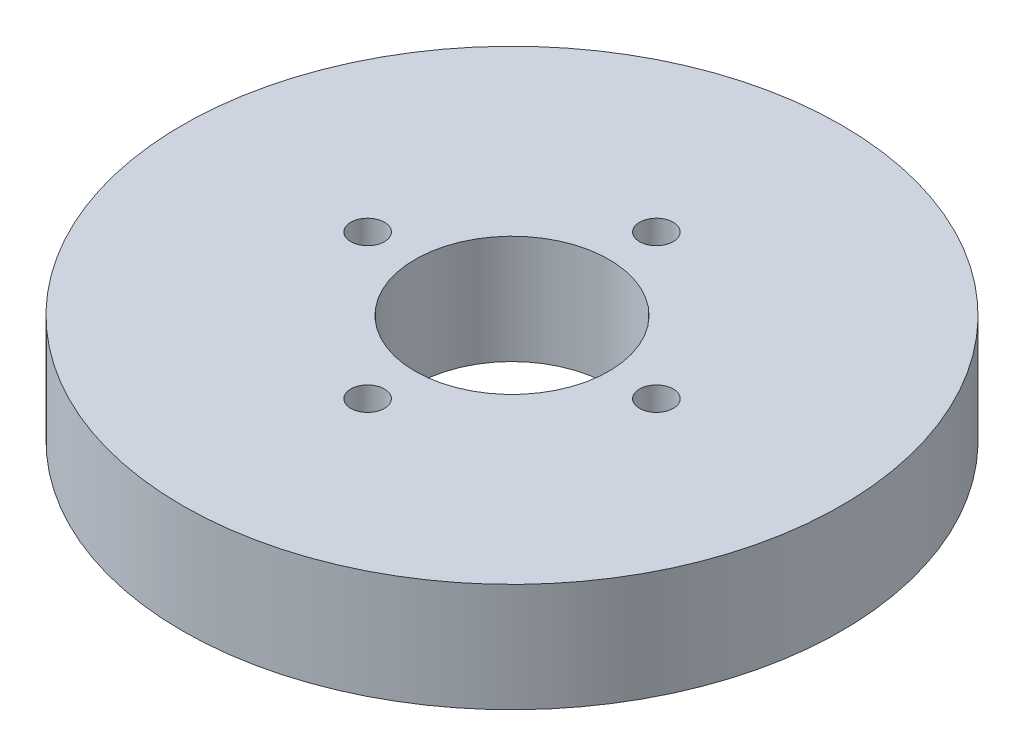
ISO-10303-21;
HEADER;
FILE_DESCRIPTION(('STEP AP214'),'2;1');
FILE_NAME('part.step','',(''),(''),'','','');
FILE_SCHEMA(('AUTOMOTIVE_DESIGN { 1 0 10303 214 1 1 1 1 }'));
ENDSEC;
DATA;
#1=APPLICATION_CONTEXT('core data for automotive mechanical design processes');
#2=APPLICATION_PROTOCOL_DEFINITION('international standard','automotive_design',2000,#1);
#3=PRODUCT_CONTEXT('',#1,'mechanical');
#4=PRODUCT('Part','Part','',(#3));
#5=PRODUCT_RELATED_PRODUCT_CATEGORY('part','',(#4));
#6=PRODUCT_DEFINITION_FORMATION('','',#4);
#7=PRODUCT_DEFINITION_CONTEXT('part definition',#1,'design');
#8=PRODUCT_DEFINITION('design','',#6,#7);
#9=PRODUCT_DEFINITION_SHAPE('','',#8);
#10=(LENGTH_UNIT() NAMED_UNIT(*) SI_UNIT(.MILLI.,.METRE.));
#11=(NAMED_UNIT(*) PLANE_ANGLE_UNIT() SI_UNIT($,.RADIAN.));
#12=(NAMED_UNIT(*) SI_UNIT($,.STERADIAN.) SOLID_ANGLE_UNIT());
#13=UNCERTAINTY_MEASURE_WITH_UNIT(LENGTH_MEASURE(1.E-05),#10,'distance_accuracy_value','');
#14=(GEOMETRIC_REPRESENTATION_CONTEXT(3) GLOBAL_UNCERTAINTY_ASSIGNED_CONTEXT((#13)) GLOBAL_UNIT_ASSIGNED_CONTEXT((#10,
#11,#12)) REPRESENTATION_CONTEXT('',''));
#15=CARTESIAN_POINT('',(0.,0.,0.));
#16=DIRECTION('',(0.,0.,1.));
#17=DIRECTION('',(1.,0.,0.));
#18=AXIS2_PLACEMENT_3D('',#15,#16,#17);
#19=CARTESIAN_POINT('',(0.,14.,0.));
#20=DIRECTION('',(0.,-1.,0.));
#21=DIRECTION('',(0.,0.,-1.));
#22=AXIS2_PLACEMENT_3D('',#19,#20,#21);
#23=CYLINDRICAL_SURFACE('',#22,42.5);
#24=CARTESIAN_POINT('',(0.,14.,0.));
#25=DIRECTION('',(0.,1.,0.));
#26=DIRECTION('',(0.,0.,1.));
#27=AXIS2_PLACEMENT_3D('',#24,#25,#26);
#28=CIRCLE('',#27,42.5);
#29=CARTESIAN_POINT('',(0.,14.,42.5));
#30=VERTEX_POINT('',#29);
#31=EDGE_CURVE('E10',#30,#30,#28,.T.);
#32=ORIENTED_EDGE('',*,*,#31,.F.);
#33=EDGE_LOOP('',(#32));
#34=FACE_BOUND('',#33,.T.);
#35=CARTESIAN_POINT('',(0.,0.,0.));
#36=DIRECTION('',(0.,1.,0.));
#37=DIRECTION('',(0.,0.,1.));
#38=AXIS2_PLACEMENT_3D('',#35,#36,#37);
#39=CIRCLE('',#38,42.5);
#40=CARTESIAN_POINT('',(0.,0.,42.5));
#41=VERTEX_POINT('',#40);
#42=EDGE_CURVE('E37',#41,#41,#39,.T.);
#43=ORIENTED_EDGE('',*,*,#42,.T.);
#44=EDGE_LOOP('',(#43));
#45=FACE_BOUND('',#44,.T.);
#46=ADVANCED_FACE('F40',(#34,#45),#23,.T.);
#47=CARTESIAN_POINT('',(0.,14.,0.));
#48=DIRECTION('',(0.,1.,0.));
#49=DIRECTION('',(0.,0.,1.));
#50=AXIS2_PLACEMENT_3D('',#47,#48,#49);
#51=PLANE('',#50);
#52=CARTESIAN_POINT('',(0.,14.,18.6195365157086));
#53=DIRECTION('',(0.,1.,0.));
#54=DIRECTION('',(1.,0.,0.));
#55=AXIS2_PLACEMENT_3D('',#52,#53,#54);
#56=CIRCLE('',#55,2.17306928861069);
#57=CARTESIAN_POINT('',(2.17306928861076,14.,18.6195365157086));
#58=VERTEX_POINT('',#57);
#59=EDGE_CURVE('E71',#58,#58,#56,.T.);
#60=ORIENTED_EDGE('',*,*,#59,.F.);
#61=EDGE_LOOP('',(#60));
#62=FACE_BOUND('',#61,.T.);
#63=CARTESIAN_POINT('',(18.6195365157086,14.,0.));
#64=DIRECTION('',(0.,1.,0.));
#65=DIRECTION('',(0.,0.,-1.));
#66=AXIS2_PLACEMENT_3D('',#63,#64,#65);
#67=CIRCLE('',#66,2.17306928861069);
#68=CARTESIAN_POINT('',(18.6195365157086,14.,-2.17306928861069));
#69=VERTEX_POINT('',#68);
#70=EDGE_CURVE('E70',#69,#69,#67,.T.);
#71=ORIENTED_EDGE('',*,*,#70,.F.);
#72=EDGE_LOOP('',(#71));
#73=FACE_BOUND('',#72,.T.);
#74=CARTESIAN_POINT('',(-1.95029292847515E-13,14.,-18.6195365157086));
#75=DIRECTION('',(0.,1.,0.));
#76=DIRECTION('',(-1.,0.,0.));
#77=AXIS2_PLACEMENT_3D('',#74,#75,#76);
#78=CIRCLE('',#77,2.17306928861069);
#79=CARTESIAN_POINT('',(-2.17306928861089,14.,-18.6195365157086));
#80=VERTEX_POINT('',#79);
#81=EDGE_CURVE('E61',#80,#80,#78,.T.);
#82=ORIENTED_EDGE('',*,*,#81,.F.);
#83=EDGE_LOOP('',(#82));
#84=FACE_BOUND('',#83,.T.);
#85=CARTESIAN_POINT('',(-18.6195365157086,14.,0.));
#86=DIRECTION('',(0.,1.,0.));
#87=DIRECTION('',(0.,0.,1.));
#88=AXIS2_PLACEMENT_3D('',#85,#86,#87);
#89=CIRCLE('',#88,2.17306928861069);
#90=CARTESIAN_POINT('',(-18.6195365157086,14.,2.17306928861069));
#91=VERTEX_POINT('',#90);
#92=EDGE_CURVE('E54',#91,#91,#89,.T.);
#93=ORIENTED_EDGE('',*,*,#92,.F.);
#94=EDGE_LOOP('',(#93));
#95=FACE_BOUND('',#94,.T.);
#96=CARTESIAN_POINT('',(0.,14.,0.));
#97=DIRECTION('',(0.,1.,0.));
#98=DIRECTION('',(0.,0.,1.));
#99=AXIS2_PLACEMENT_3D('',#96,#97,#98);
#100=CIRCLE('',#99,12.5);
#101=CARTESIAN_POINT('',(0.,14.,12.5));
#102=VERTEX_POINT('',#101);
#103=EDGE_CURVE('E50',#102,#102,#100,.T.);
#104=ORIENTED_EDGE('',*,*,#103,.F.);
#105=EDGE_LOOP('',(#104));
#106=FACE_BOUND('',#105,.T.);
#107=ORIENTED_EDGE('',*,*,#31,.T.);
#108=EDGE_LOOP('',(#107));
#109=FACE_BOUND('',#108,.T.);
#110=ADVANCED_FACE('F86',(#62,#73,#84,#95,#106,#109),#51,.T.);
#111=CARTESIAN_POINT('',(0.,0.,0.));
#112=DIRECTION('',(0.,1.,0.));
#113=DIRECTION('',(0.,0.,1.));
#114=AXIS2_PLACEMENT_3D('',#111,#112,#113);
#115=PLANE('',#114);
#116=CARTESIAN_POINT('',(0.,0.,0.));
#117=DIRECTION('',(0.,1.,0.));
#118=DIRECTION('',(0.,0.,1.));
#119=AXIS2_PLACEMENT_3D('',#116,#117,#118);
#120=CIRCLE('',#119,12.5);
#121=CARTESIAN_POINT('',(0.,0.,12.5));
#122=VERTEX_POINT('',#121);
#123=EDGE_CURVE('E47',#122,#122,#120,.T.);
#124=ORIENTED_EDGE('',*,*,#123,.T.);
#125=EDGE_LOOP('',(#124));
#126=FACE_BOUND('',#125,.T.);
#127=ORIENTED_EDGE('',*,*,#42,.F.);
#128=EDGE_LOOP('',(#127));
#129=FACE_BOUND('',#128,.T.);
#130=ADVANCED_FACE('F93',(#126,#129),#115,.F.);
#131=CARTESIAN_POINT('',(0.,14.,0.));
#132=DIRECTION('',(0.,-1.,0.));
#133=DIRECTION('',(0.,0.,-1.));
#134=AXIS2_PLACEMENT_3D('',#131,#132,#133);
#135=CYLINDRICAL_SURFACE('',#134,12.5);
#136=ORIENTED_EDGE('',*,*,#103,.T.);
#137=EDGE_LOOP('',(#136));
#138=FACE_BOUND('',#137,.T.);
#139=ORIENTED_EDGE('',*,*,#123,.F.);
#140=EDGE_LOOP('',(#139));
#141=FACE_BOUND('',#140,.T.);
#142=ADVANCED_FACE('F101',(#138,#141),#135,.F.);
#143=CARTESIAN_POINT('',(-18.6195365157086,4.72178488608704,0.));
#144=DIRECTION('',(0.,1.,0.));
#145=DIRECTION('',(0.,0.,1.));
#146=AXIS2_PLACEMENT_3D('',#143,#144,#145);
#147=CYLINDRICAL_SURFACE('',#146,2.17306928861069);
#148=CARTESIAN_POINT('',(-18.6195365157086,4.72178488608704,0.));
#149=DIRECTION('',(0.,1.,0.));
#150=DIRECTION('',(0.,0.,1.));
#151=AXIS2_PLACEMENT_3D('',#148,#149,#150);
#152=CIRCLE('',#151,2.17306928861069);
#153=CARTESIAN_POINT('',(-18.6195365157086,4.72178488608704,2.17306928861069));
#154=VERTEX_POINT('',#153);
#155=EDGE_CURVE('E55',#154,#154,#152,.T.);
#156=ORIENTED_EDGE('',*,*,#155,.F.);
#157=EDGE_LOOP('',(#156));
#158=FACE_BOUND('',#157,.T.);
#159=ORIENTED_EDGE('',*,*,#92,.T.);
#160=EDGE_LOOP('',(#159));
#161=FACE_BOUND('',#160,.T.);
#162=ADVANCED_FACE('F102',(#158,#161),#147,.F.);
#163=CARTESIAN_POINT('',(-18.6195365157086,4.72178488608704,0.));
#164=DIRECTION('',(0.,1.,0.));
#165=DIRECTION('',(0.,0.,1.));
#166=AXIS2_PLACEMENT_3D('',#163,#164,#165);
#167=PLANE('',#166);
#168=ORIENTED_EDGE('',*,*,#155,.T.);
#169=EDGE_LOOP('',(#168));
#170=FACE_BOUND('',#169,.T.);
#171=ADVANCED_FACE('F133',(#170),#167,.T.);
#172=CARTESIAN_POINT('',(-1.95029292847515E-13,4.72178488608704,-18.6195365157086));
#173=DIRECTION('',(0.,1.,0.));
#174=DIRECTION('',(0.,0.,1.));
#175=AXIS2_PLACEMENT_3D('',#172,#173,#174);
#176=CYLINDRICAL_SURFACE('',#175,2.17306928861069);
#177=CARTESIAN_POINT('',(-1.95029292847515E-13,4.72178488608704,-18.6195365157086));
#178=DIRECTION('',(0.,1.,0.));
#179=DIRECTION('',(-1.,0.,0.));
#180=AXIS2_PLACEMENT_3D('',#177,#178,#179);
#181=CIRCLE('',#180,2.17306928861069);
#182=CARTESIAN_POINT('',(-2.17306928861089,4.72178488608704,-18.6195365157086));
#183=VERTEX_POINT('',#182);
#184=EDGE_CURVE('E63',#183,#183,#181,.T.);
#185=ORIENTED_EDGE('',*,*,#184,.F.);
#186=EDGE_LOOP('',(#185));
#187=FACE_BOUND('',#186,.T.);
#188=ORIENTED_EDGE('',*,*,#81,.T.);
#189=EDGE_LOOP('',(#188));
#190=FACE_BOUND('',#189,.T.);
#191=ADVANCED_FACE('F142',(#187,#190),#176,.F.);
#192=CARTESIAN_POINT('',(-1.95029292847515E-13,4.72178488608704,-18.6195365157086));
#193=DIRECTION('',(0.,1.,0.));
#194=DIRECTION('',(-1.,0.,0.));
#195=AXIS2_PLACEMENT_3D('',#192,#193,#194);
#196=PLANE('',#195);
#197=ORIENTED_EDGE('',*,*,#184,.T.);
#198=EDGE_LOOP('',(#197));
#199=FACE_BOUND('',#198,.T.);
#200=ADVANCED_FACE('F156',(#199),#196,.T.);
#201=CARTESIAN_POINT('',(18.6195365157086,4.72178488608704,0.));
#202=DIRECTION('',(0.,1.,0.));
#203=DIRECTION('',(0.,0.,1.));
#204=AXIS2_PLACEMENT_3D('',#201,#202,#203);
#205=CYLINDRICAL_SURFACE('',#204,2.17306928861069);
#206=CARTESIAN_POINT('',(18.6195365157086,4.72178488608704,0.));
#207=DIRECTION('',(0.,1.,0.));
#208=DIRECTION('',(0.,0.,-1.));
#209=AXIS2_PLACEMENT_3D('',#206,#207,#208);
#210=CIRCLE('',#209,2.17306928861069);
#211=CARTESIAN_POINT('',(18.6195365157086,4.72178488608704,-2.17306928861069));
#212=VERTEX_POINT('',#211);
#213=EDGE_CURVE('E69',#212,#212,#210,.T.);
#214=ORIENTED_EDGE('',*,*,#213,.F.);
#215=EDGE_LOOP('',(#214));
#216=FACE_BOUND('',#215,.T.);
#217=ORIENTED_EDGE('',*,*,#70,.T.);
#218=EDGE_LOOP('',(#217));
#219=FACE_BOUND('',#218,.T.);
#220=ADVANCED_FACE('F164',(#216,#219),#205,.F.);
#221=CARTESIAN_POINT('',(18.6195365157086,4.72178488608704,0.));
#222=DIRECTION('',(0.,1.,0.));
#223=DIRECTION('',(0.,0.,-1.));
#224=AXIS2_PLACEMENT_3D('',#221,#222,#223);
#225=PLANE('',#224);
#226=ORIENTED_EDGE('',*,*,#213,.T.);
#227=EDGE_LOOP('',(#226));
#228=FACE_BOUND('',#227,.T.);
#229=ADVANCED_FACE('F83',(#228),#225,.T.);
#230=CARTESIAN_POINT('',(0.,4.72178488608704,18.6195365157086));
#231=DIRECTION('',(0.,1.,0.));
#232=DIRECTION('',(0.,0.,1.));
#233=AXIS2_PLACEMENT_3D('',#230,#231,#232);
#234=CYLINDRICAL_SURFACE('',#233,2.17306928861069);
#235=CARTESIAN_POINT('',(0.,4.72178488608704,18.6195365157086));
#236=DIRECTION('',(0.,1.,0.));
#237=DIRECTION('',(1.,0.,0.));
#238=AXIS2_PLACEMENT_3D('',#235,#236,#237);
#239=CIRCLE('',#238,2.17306928861069);
#240=CARTESIAN_POINT('',(2.17306928861076,4.72178488608704,18.6195365157086));
#241=VERTEX_POINT('',#240);
#242=EDGE_CURVE('E59',#241,#241,#239,.T.);
#243=ORIENTED_EDGE('',*,*,#242,.F.);
#244=EDGE_LOOP('',(#243));
#245=FACE_BOUND('',#244,.T.);
#246=ORIENTED_EDGE('',*,*,#59,.T.);
#247=EDGE_LOOP('',(#246));
#248=FACE_BOUND('',#247,.T.);
#249=ADVANCED_FACE('F81',(#245,#248),#234,.F.);
#250=CARTESIAN_POINT('',(0.,4.72178488608704,18.6195365157086));
#251=DIRECTION('',(0.,1.,0.));
#252=DIRECTION('',(1.,0.,0.));
#253=AXIS2_PLACEMENT_3D('',#250,#251,#252);
#254=PLANE('',#253);
#255=ORIENTED_EDGE('',*,*,#242,.T.);
#256=EDGE_LOOP('',(#255));
#257=FACE_BOUND('',#256,.T.);
#258=ADVANCED_FACE('F78',(#257),#254,.T.);
#259=CLOSED_SHELL('',(#46,#110,#130,#142,#162,#171,#191,#200,#220,#229,#249,#258));
#260=MANIFOLD_SOLID_BREP('B2',#259);
#261=ADVANCED_BREP_SHAPE_REPRESENTATION('',(#18,#260),#14);
#262=SHAPE_DEFINITION_REPRESENTATION(#9,#261);
ENDSEC;
END-ISO-10303-21;
